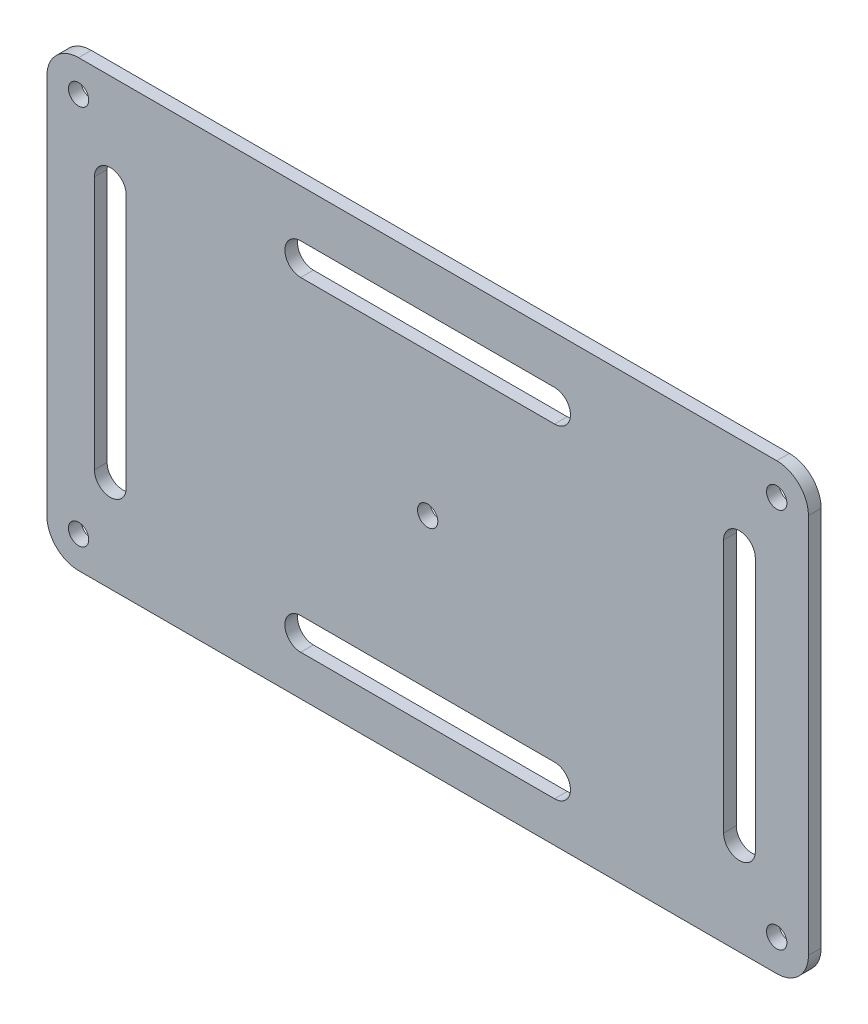
ISO-10303-21;
HEADER;
FILE_DESCRIPTION(('STEP AP214'),'2;1');
FILE_NAME('part.step','',(''),(''),'','','');
FILE_SCHEMA(('AUTOMOTIVE_DESIGN { 1 0 10303 214 1 1 1 1 }'));
ENDSEC;
DATA;
#1=APPLICATION_CONTEXT('core data for automotive mechanical design processes');
#2=APPLICATION_PROTOCOL_DEFINITION('international standard','automotive_design',2000,#1);
#3=PRODUCT_CONTEXT('',#1,'mechanical');
#4=PRODUCT('Part','Part','',(#3));
#5=PRODUCT_RELATED_PRODUCT_CATEGORY('part','',(#4));
#6=PRODUCT_DEFINITION_FORMATION('','',#4);
#7=PRODUCT_DEFINITION_CONTEXT('part definition',#1,'design');
#8=PRODUCT_DEFINITION('design','',#6,#7);
#9=PRODUCT_DEFINITION_SHAPE('','',#8);
#10=(LENGTH_UNIT() NAMED_UNIT(*) SI_UNIT(.MILLI.,.METRE.));
#11=(NAMED_UNIT(*) PLANE_ANGLE_UNIT() SI_UNIT($,.RADIAN.));
#12=(NAMED_UNIT(*) SI_UNIT($,.STERADIAN.) SOLID_ANGLE_UNIT());
#13=UNCERTAINTY_MEASURE_WITH_UNIT(LENGTH_MEASURE(1.E-05),#10,'distance_accuracy_value','');
#14=(GEOMETRIC_REPRESENTATION_CONTEXT(3) GLOBAL_UNCERTAINTY_ASSIGNED_CONTEXT((#13)) GLOBAL_UNIT_ASSIGNED_CONTEXT((#10,
#11,#12)) REPRESENTATION_CONTEXT('',''));
#15=CARTESIAN_POINT('',(0.,0.,0.));
#16=DIRECTION('',(0.,0.,1.));
#17=DIRECTION('',(1.,0.,0.));
#18=AXIS2_PLACEMENT_3D('',#15,#16,#17);
#19=CARTESIAN_POINT('',(60.,0.,2.));
#20=DIRECTION('',(1.,0.,0.));
#21=DIRECTION('',(0.,0.,-1.));
#22=AXIS2_PLACEMENT_3D('',#19,#20,#21);
#23=PLANE('',#22);
#24=DIRECTION('',(0.,-1.,0.));
#25=VECTOR('',#24,1.);
#26=CARTESIAN_POINT('',(60.,0.,0.));
#27=LINE('',#26,#25);
#28=CARTESIAN_POINT('',(60.,30.,0.));
#29=VERTEX_POINT('',#28);
#30=CARTESIAN_POINT('',(60.,-30.,0.));
#31=VERTEX_POINT('',#30);
#32=EDGE_CURVE('E299',#29,#31,#27,.T.);
#33=ORIENTED_EDGE('',*,*,#32,.F.);
#34=DIRECTION('',(0.,0.,-1.));
#35=VECTOR('',#34,1.);
#36=CARTESIAN_POINT('',(60.,30.,2.));
#37=LINE('',#36,#35);
#38=CARTESIAN_POINT('',(60.,30.,2.));
#39=VERTEX_POINT('',#38);
#40=EDGE_CURVE('E11',#39,#29,#37,.T.);
#41=ORIENTED_EDGE('',*,*,#40,.F.);
#42=DIRECTION('',(0.,-1.,0.));
#43=VECTOR('',#42,1.);
#44=CARTESIAN_POINT('',(60.,0.,2.));
#45=LINE('',#44,#43);
#46=CARTESIAN_POINT('',(60.,-30.,2.));
#47=VERTEX_POINT('',#46);
#48=EDGE_CURVE('E419',#39,#47,#45,.T.);
#49=ORIENTED_EDGE('',*,*,#48,.T.);
#50=DIRECTION('',(0.,0.,-1.));
#51=VECTOR('',#50,1.);
#52=CARTESIAN_POINT('',(60.,-30.,2.));
#53=LINE('',#52,#51);
#54=EDGE_CURVE('E140',#47,#31,#53,.T.);
#55=ORIENTED_EDGE('',*,*,#54,.T.);
#56=EDGE_LOOP('',(#33,#41,#49,#55));
#57=FACE_BOUND('',#56,.T.);
#58=ADVANCED_FACE('F39',(#57),#23,.T.);
#59=CARTESIAN_POINT('',(55.,30.,2.));
#60=DIRECTION('',(0.,0.,-1.));
#61=DIRECTION('',(-1.,0.,0.));
#62=AXIS2_PLACEMENT_3D('',#59,#60,#61);
#63=CYLINDRICAL_SURFACE('',#62,5.);
#64=CARTESIAN_POINT('',(55.,30.,0.));
#65=DIRECTION('',(0.,0.,1.));
#66=DIRECTION('',(1.,0.,0.));
#67=AXIS2_PLACEMENT_3D('',#64,#65,#66);
#68=CIRCLE('',#67,5.);
#69=CARTESIAN_POINT('',(55.,35.,0.));
#70=VERTEX_POINT('',#69);
#71=EDGE_CURVE('E302',#29,#70,#68,.T.);
#72=ORIENTED_EDGE('',*,*,#71,.T.);
#73=DIRECTION('',(0.,0.,-1.));
#74=VECTOR('',#73,1.);
#75=CARTESIAN_POINT('',(55.,35.,2.));
#76=LINE('',#75,#74);
#77=CARTESIAN_POINT('',(55.,35.,2.));
#78=VERTEX_POINT('',#77);
#79=EDGE_CURVE('E49',#78,#70,#76,.T.);
#80=ORIENTED_EDGE('',*,*,#79,.F.);
#81=CARTESIAN_POINT('',(55.,30.,2.));
#82=DIRECTION('',(0.,0.,1.));
#83=DIRECTION('',(1.,0.,0.));
#84=AXIS2_PLACEMENT_3D('',#81,#82,#83);
#85=CIRCLE('',#84,5.);
#86=EDGE_CURVE('E421',#39,#78,#85,.T.);
#87=ORIENTED_EDGE('',*,*,#86,.F.);
#88=ORIENTED_EDGE('',*,*,#40,.T.);
#89=EDGE_LOOP('',(#72,#80,#87,#88));
#90=FACE_BOUND('',#89,.T.);
#91=ADVANCED_FACE('F450',(#90),#63,.T.);
#92=CARTESIAN_POINT('',(0.,35.,2.));
#93=DIRECTION('',(0.,-1.,0.));
#94=DIRECTION('',(0.,0.,-1.));
#95=AXIS2_PLACEMENT_3D('',#92,#93,#94);
#96=PLANE('',#95);
#97=DIRECTION('',(-1.,0.,0.));
#98=VECTOR('',#97,1.);
#99=CARTESIAN_POINT('',(0.,35.,0.));
#100=LINE('',#99,#98);
#101=CARTESIAN_POINT('',(-55.,35.,0.));
#102=VERTEX_POINT('',#101);
#103=EDGE_CURVE('E305',#70,#102,#100,.T.);
#104=ORIENTED_EDGE('',*,*,#103,.T.);
#105=DIRECTION('',(0.,0.,-1.));
#106=VECTOR('',#105,1.);
#107=CARTESIAN_POINT('',(-55.,35.,2.));
#108=LINE('',#107,#106);
#109=CARTESIAN_POINT('',(-55.,35.,2.));
#110=VERTEX_POINT('',#109);
#111=EDGE_CURVE('E326',#110,#102,#108,.T.);
#112=ORIENTED_EDGE('',*,*,#111,.F.);
#113=DIRECTION('',(-1.,0.,0.));
#114=VECTOR('',#113,1.);
#115=CARTESIAN_POINT('',(0.,35.,2.));
#116=LINE('',#115,#114);
#117=EDGE_CURVE('E424',#78,#110,#116,.T.);
#118=ORIENTED_EDGE('',*,*,#117,.F.);
#119=ORIENTED_EDGE('',*,*,#79,.T.);
#120=EDGE_LOOP('',(#104,#112,#118,#119));
#121=FACE_BOUND('',#120,.T.);
#122=ADVANCED_FACE('F435',(#121),#96,.F.);
#123=CARTESIAN_POINT('',(-55.,30.,2.));
#124=DIRECTION('',(0.,0.,-1.));
#125=DIRECTION('',(-1.,0.,0.));
#126=AXIS2_PLACEMENT_3D('',#123,#124,#125);
#127=CYLINDRICAL_SURFACE('',#126,5.);
#128=CARTESIAN_POINT('',(-55.,30.,0.));
#129=DIRECTION('',(0.,0.,1.));
#130=DIRECTION('',(1.,0.,0.));
#131=AXIS2_PLACEMENT_3D('',#128,#129,#130);
#132=CIRCLE('',#131,5.);
#133=CARTESIAN_POINT('',(-60.,30.,0.));
#134=VERTEX_POINT('',#133);
#135=EDGE_CURVE('E308',#134,#102,#132,.F.);
#136=ORIENTED_EDGE('',*,*,#135,.F.);
#137=DIRECTION('',(0.,0.,-1.));
#138=VECTOR('',#137,1.);
#139=CARTESIAN_POINT('',(-60.,30.,2.));
#140=LINE('',#139,#138);
#141=CARTESIAN_POINT('',(-60.,30.,2.));
#142=VERTEX_POINT('',#141);
#143=EDGE_CURVE('E324',#142,#134,#140,.T.);
#144=ORIENTED_EDGE('',*,*,#143,.F.);
#145=CARTESIAN_POINT('',(-55.,30.,2.));
#146=DIRECTION('',(0.,0.,1.));
#147=DIRECTION('',(1.,0.,0.));
#148=AXIS2_PLACEMENT_3D('',#145,#146,#147);
#149=CIRCLE('',#148,5.);
#150=EDGE_CURVE('E426',#142,#110,#149,.F.);
#151=ORIENTED_EDGE('',*,*,#150,.T.);
#152=ORIENTED_EDGE('',*,*,#111,.T.);
#153=EDGE_LOOP('',(#136,#144,#151,#152));
#154=FACE_BOUND('',#153,.T.);
#155=ADVANCED_FACE('F430',(#154),#127,.T.);
#156=CARTESIAN_POINT('',(-60.,0.,2.));
#157=DIRECTION('',(1.,0.,0.));
#158=DIRECTION('',(0.,0.,-1.));
#159=AXIS2_PLACEMENT_3D('',#156,#157,#158);
#160=PLANE('',#159);
#161=DIRECTION('',(0.,-1.,0.));
#162=VECTOR('',#161,1.);
#163=CARTESIAN_POINT('',(-60.,0.,0.));
#164=LINE('',#163,#162);
#165=CARTESIAN_POINT('',(-60.,-30.,0.));
#166=VERTEX_POINT('',#165);
#167=EDGE_CURVE('E311',#134,#166,#164,.T.);
#168=ORIENTED_EDGE('',*,*,#167,.T.);
#169=DIRECTION('',(0.,0.,-1.));
#170=VECTOR('',#169,1.);
#171=CARTESIAN_POINT('',(-60.,-30.,2.));
#172=LINE('',#171,#170);
#173=CARTESIAN_POINT('',(-60.,-30.,2.));
#174=VERTEX_POINT('',#173);
#175=EDGE_CURVE('E228',#174,#166,#172,.T.);
#176=ORIENTED_EDGE('',*,*,#175,.F.);
#177=DIRECTION('',(0.,-1.,0.));
#178=VECTOR('',#177,1.);
#179=CARTESIAN_POINT('',(-60.,0.,2.));
#180=LINE('',#179,#178);
#181=EDGE_CURVE('E216',#142,#174,#180,.T.);
#182=ORIENTED_EDGE('',*,*,#181,.F.);
#183=ORIENTED_EDGE('',*,*,#143,.T.);
#184=EDGE_LOOP('',(#168,#176,#182,#183));
#185=FACE_BOUND('',#184,.T.);
#186=ADVANCED_FACE('F440',(#185),#160,.F.);
#187=CARTESIAN_POINT('',(-55.,-30.,2.));
#188=DIRECTION('',(0.,0.,-1.));
#189=DIRECTION('',(-1.,0.,0.));
#190=AXIS2_PLACEMENT_3D('',#187,#188,#189);
#191=CYLINDRICAL_SURFACE('',#190,5.);
#192=CARTESIAN_POINT('',(-55.,-30.,0.));
#193=DIRECTION('',(0.,0.,1.));
#194=DIRECTION('',(1.,0.,0.));
#195=AXIS2_PLACEMENT_3D('',#192,#193,#194);
#196=CIRCLE('',#195,5.);
#197=CARTESIAN_POINT('',(-55.,-35.,0.));
#198=VERTEX_POINT('',#197);
#199=EDGE_CURVE('E224',#166,#198,#196,.T.);
#200=ORIENTED_EDGE('',*,*,#199,.T.);
#201=DIRECTION('',(0.,0.,-1.));
#202=VECTOR('',#201,1.);
#203=CARTESIAN_POINT('',(-55.,-35.,2.));
#204=LINE('',#203,#202);
#205=CARTESIAN_POINT('',(-55.,-35.,2.));
#206=VERTEX_POINT('',#205);
#207=EDGE_CURVE('E222',#206,#198,#204,.T.);
#208=ORIENTED_EDGE('',*,*,#207,.F.);
#209=CARTESIAN_POINT('',(-55.,-30.,2.));
#210=DIRECTION('',(0.,0.,1.));
#211=DIRECTION('',(1.,0.,0.));
#212=AXIS2_PLACEMENT_3D('',#209,#210,#211);
#213=CIRCLE('',#212,5.);
#214=EDGE_CURVE('E209',#174,#206,#213,.T.);
#215=ORIENTED_EDGE('',*,*,#214,.F.);
#216=ORIENTED_EDGE('',*,*,#175,.T.);
#217=EDGE_LOOP('',(#200,#208,#215,#216));
#218=FACE_BOUND('',#217,.T.);
#219=ADVANCED_FACE('F223',(#218),#191,.T.);
#220=CARTESIAN_POINT('',(0.,-35.,2.));
#221=DIRECTION('',(0.,-1.,0.));
#222=DIRECTION('',(0.,0.,-1.));
#223=AXIS2_PLACEMENT_3D('',#220,#221,#222);
#224=PLANE('',#223);
#225=DIRECTION('',(-1.,0.,0.));
#226=VECTOR('',#225,1.);
#227=CARTESIAN_POINT('',(0.,-35.,0.));
#228=LINE('',#227,#226);
#229=CARTESIAN_POINT('',(55.,-35.,0.));
#230=VERTEX_POINT('',#229);
#231=EDGE_CURVE('E315',#230,#198,#228,.T.);
#232=ORIENTED_EDGE('',*,*,#231,.F.);
#233=DIRECTION('',(0.,0.,-1.));
#234=VECTOR('',#233,1.);
#235=CARTESIAN_POINT('',(55.,-35.,2.));
#236=LINE('',#235,#234);
#237=CARTESIAN_POINT('',(55.,-35.,2.));
#238=VERTEX_POINT('',#237);
#239=EDGE_CURVE('E133',#238,#230,#236,.T.);
#240=ORIENTED_EDGE('',*,*,#239,.F.);
#241=DIRECTION('',(-1.,0.,0.));
#242=VECTOR('',#241,1.);
#243=CARTESIAN_POINT('',(0.,-35.,2.));
#244=LINE('',#243,#242);
#245=EDGE_CURVE('E213',#238,#206,#244,.T.);
#246=ORIENTED_EDGE('',*,*,#245,.T.);
#247=ORIENTED_EDGE('',*,*,#207,.T.);
#248=EDGE_LOOP('',(#232,#240,#246,#247));
#249=FACE_BOUND('',#248,.T.);
#250=ADVANCED_FACE('F230',(#249),#224,.T.);
#251=CARTESIAN_POINT('',(49.1288715711617,-20.,2.));
#252=DIRECTION('',(0.,0.,-1.));
#253=DIRECTION('',(-1.,0.,0.));
#254=AXIS2_PLACEMENT_3D('',#251,#252,#253);
#255=CYLINDRICAL_SURFACE('',#254,2.50000000000001);
#256=CARTESIAN_POINT('',(49.1288715711617,-20.,0.));
#257=DIRECTION('',(0.,0.,1.));
#258=DIRECTION('',(1.,0.,0.));
#259=AXIS2_PLACEMENT_3D('',#256,#257,#258);
#260=CIRCLE('',#259,2.50000000000001);
#261=CARTESIAN_POINT('',(46.6288715711617,-20.,0.));
#262=VERTEX_POINT('',#261);
#263=CARTESIAN_POINT('',(51.6288715711617,-20.,0.));
#264=VERTEX_POINT('',#263);
#265=EDGE_CURVE('E287',#262,#264,#260,.T.);
#266=ORIENTED_EDGE('',*,*,#265,.F.);
#267=DIRECTION('',(0.,0.,-1.));
#268=VECTOR('',#267,1.);
#269=CARTESIAN_POINT('',(46.6288715711617,-20.,2.));
#270=LINE('',#269,#268);
#271=CARTESIAN_POINT('',(46.6288715711617,-20.,2.));
#272=VERTEX_POINT('',#271);
#273=EDGE_CURVE('E321',#272,#262,#270,.T.);
#274=ORIENTED_EDGE('',*,*,#273,.F.);
#275=CARTESIAN_POINT('',(49.1288715711617,-20.,2.));
#276=DIRECTION('',(0.,0.,1.));
#277=DIRECTION('',(1.,0.,0.));
#278=AXIS2_PLACEMENT_3D('',#275,#276,#277);
#279=CIRCLE('',#278,2.50000000000001);
#280=CARTESIAN_POINT('',(51.6288715711617,-20.,2.));
#281=VERTEX_POINT('',#280);
#282=EDGE_CURVE('E408',#272,#281,#279,.T.);
#283=ORIENTED_EDGE('',*,*,#282,.T.);
#284=DIRECTION('',(0.,0.,-1.));
#285=VECTOR('',#284,1.);
#286=CARTESIAN_POINT('',(51.6288715711617,-20.,2.));
#287=LINE('',#286,#285);
#288=EDGE_CURVE('E330',#281,#264,#287,.T.);
#289=ORIENTED_EDGE('',*,*,#288,.T.);
#290=EDGE_LOOP('',(#266,#274,#283,#289));
#291=FACE_BOUND('',#290,.T.);
#292=ADVANCED_FACE('F472',(#291),#255,.F.);
#293=CARTESIAN_POINT('',(46.6288715711617,0.,2.));
#294=DIRECTION('',(1.,0.,0.));
#295=DIRECTION('',(0.,1.,0.));
#296=AXIS2_PLACEMENT_3D('',#293,#294,#295);
#297=PLANE('',#296);
#298=DIRECTION('',(0.,-1.,0.));
#299=VECTOR('',#298,1.);
#300=CARTESIAN_POINT('',(46.6288715711617,0.,0.));
#301=LINE('',#300,#299);
#302=CARTESIAN_POINT('',(46.6288715711617,20.,0.));
#303=VERTEX_POINT('',#302);
#304=EDGE_CURVE('E290',#303,#262,#301,.T.);
#305=ORIENTED_EDGE('',*,*,#304,.F.);
#306=DIRECTION('',(0.,0.,-1.));
#307=VECTOR('',#306,1.);
#308=CARTESIAN_POINT('',(46.6288715711617,20.,2.));
#309=LINE('',#308,#307);
#310=CARTESIAN_POINT('',(46.6288715711617,20.,2.));
#311=VERTEX_POINT('',#310);
#312=EDGE_CURVE('E335',#311,#303,#309,.T.);
#313=ORIENTED_EDGE('',*,*,#312,.F.);
#314=DIRECTION('',(0.,-1.,0.));
#315=VECTOR('',#314,1.);
#316=CARTESIAN_POINT('',(46.6288715711617,0.,2.));
#317=LINE('',#316,#315);
#318=EDGE_CURVE('E411',#311,#272,#317,.T.);
#319=ORIENTED_EDGE('',*,*,#318,.T.);
#320=ORIENTED_EDGE('',*,*,#273,.T.);
#321=EDGE_LOOP('',(#305,#313,#319,#320));
#322=FACE_BOUND('',#321,.T.);
#323=ADVANCED_FACE('F468',(#322),#297,.T.);
#324=CARTESIAN_POINT('',(49.1288715711617,20.,2.));
#325=DIRECTION('',(0.,0.,-1.));
#326=DIRECTION('',(-1.,0.,0.));
#327=AXIS2_PLACEMENT_3D('',#324,#325,#326);
#328=CYLINDRICAL_SURFACE('',#327,2.50000000000001);
#329=CARTESIAN_POINT('',(49.1288715711617,20.,0.));
#330=DIRECTION('',(0.,0.,1.));
#331=DIRECTION('',(1.,0.,0.));
#332=AXIS2_PLACEMENT_3D('',#329,#330,#331);
#333=CIRCLE('',#332,2.50000000000001);
#334=CARTESIAN_POINT('',(51.6288715711617,20.,0.));
#335=VERTEX_POINT('',#334);
#336=EDGE_CURVE('E293',#335,#303,#333,.T.);
#337=ORIENTED_EDGE('',*,*,#336,.F.);
#338=DIRECTION('',(0.,0.,-1.));
#339=VECTOR('',#338,1.);
#340=CARTESIAN_POINT('',(51.6288715711617,20.,2.));
#341=LINE('',#340,#339);
#342=CARTESIAN_POINT('',(51.6288715711617,20.,2.));
#343=VERTEX_POINT('',#342);
#344=EDGE_CURVE('E332',#343,#335,#341,.T.);
#345=ORIENTED_EDGE('',*,*,#344,.F.);
#346=CARTESIAN_POINT('',(49.1288715711617,20.,2.));
#347=DIRECTION('',(0.,0.,1.));
#348=DIRECTION('',(1.,0.,0.));
#349=AXIS2_PLACEMENT_3D('',#346,#347,#348);
#350=CIRCLE('',#349,2.50000000000001);
#351=EDGE_CURVE('E414',#343,#311,#350,.T.);
#352=ORIENTED_EDGE('',*,*,#351,.T.);
#353=ORIENTED_EDGE('',*,*,#312,.T.);
#354=EDGE_LOOP('',(#337,#345,#352,#353));
#355=FACE_BOUND('',#354,.T.);
#356=ADVANCED_FACE('F464',(#355),#328,.F.);
#357=CARTESIAN_POINT('',(20.,-26.136211524614,2.));
#358=DIRECTION('',(0.,0.,-1.));
#359=DIRECTION('',(-1.,0.,0.));
#360=AXIS2_PLACEMENT_3D('',#357,#358,#359);
#361=CYLINDRICAL_SURFACE('',#360,2.5);
#362=CARTESIAN_POINT('',(20.,-26.136211524614,0.));
#363=DIRECTION('',(0.,0.,1.));
#364=DIRECTION('',(1.,0.,0.));
#365=AXIS2_PLACEMENT_3D('',#362,#363,#364);
#366=CIRCLE('',#365,2.5);
#367=CARTESIAN_POINT('',(20.,-28.636211524614,0.));
#368=VERTEX_POINT('',#367);
#369=CARTESIAN_POINT('',(20.,-23.636211524614,0.));
#370=VERTEX_POINT('',#369);
#371=EDGE_CURVE('E275',#368,#370,#366,.T.);
#372=ORIENTED_EDGE('',*,*,#371,.F.);
#373=DIRECTION('',(0.,0.,-1.));
#374=VECTOR('',#373,1.);
#375=CARTESIAN_POINT('',(20.,-28.636211524614,2.));
#376=LINE('',#375,#374);
#377=CARTESIAN_POINT('',(20.,-28.636211524614,2.));
#378=VERTEX_POINT('',#377);
#379=EDGE_CURVE('E333',#378,#368,#376,.T.);
#380=ORIENTED_EDGE('',*,*,#379,.F.);
#381=CARTESIAN_POINT('',(20.,-26.136211524614,2.));
#382=DIRECTION('',(0.,0.,1.));
#383=DIRECTION('',(1.,0.,0.));
#384=AXIS2_PLACEMENT_3D('',#381,#382,#383);
#385=CIRCLE('',#384,2.5);
#386=CARTESIAN_POINT('',(20.,-23.636211524614,2.));
#387=VERTEX_POINT('',#386);
#388=EDGE_CURVE('E397',#378,#387,#385,.T.);
#389=ORIENTED_EDGE('',*,*,#388,.T.);
#390=DIRECTION('',(0.,0.,-1.));
#391=VECTOR('',#390,1.);
#392=CARTESIAN_POINT('',(20.,-23.636211524614,2.));
#393=LINE('',#392,#391);
#394=EDGE_CURVE('E338',#387,#370,#393,.T.);
#395=ORIENTED_EDGE('',*,*,#394,.T.);
#396=EDGE_LOOP('',(#372,#380,#389,#395));
#397=FACE_BOUND('',#396,.T.);
#398=ADVANCED_FACE('F467',(#397),#361,.F.);
#399=CARTESIAN_POINT('',(0.,-28.636211524614,2.));
#400=DIRECTION('',(0.,1.,0.));
#401=DIRECTION('',(0.,0.,1.));
#402=AXIS2_PLACEMENT_3D('',#399,#400,#401);
#403=PLANE('',#402);
#404=DIRECTION('',(1.,0.,0.));
#405=VECTOR('',#404,1.);
#406=CARTESIAN_POINT('',(0.,-28.636211524614,0.));
#407=LINE('',#406,#405);
#408=CARTESIAN_POINT('',(-20.,-28.636211524614,0.));
#409=VERTEX_POINT('',#408);
#410=EDGE_CURVE('E278',#409,#368,#407,.T.);
#411=ORIENTED_EDGE('',*,*,#410,.F.);
#412=DIRECTION('',(0.,0.,-1.));
#413=VECTOR('',#412,1.);
#414=CARTESIAN_POINT('',(-20.,-28.636211524614,2.));
#415=LINE('',#414,#413);
#416=CARTESIAN_POINT('',(-20.,-28.636211524614,2.));
#417=VERTEX_POINT('',#416);
#418=EDGE_CURVE('E343',#417,#409,#415,.T.);
#419=ORIENTED_EDGE('',*,*,#418,.F.);
#420=DIRECTION('',(1.,0.,0.));
#421=VECTOR('',#420,1.);
#422=CARTESIAN_POINT('',(0.,-28.636211524614,2.));
#423=LINE('',#422,#421);
#424=EDGE_CURVE('E400',#417,#378,#423,.T.);
#425=ORIENTED_EDGE('',*,*,#424,.T.);
#426=ORIENTED_EDGE('',*,*,#379,.T.);
#427=EDGE_LOOP('',(#411,#419,#425,#426));
#428=FACE_BOUND('',#427,.T.);
#429=ADVANCED_FACE('F485',(#428),#403,.T.);
#430=CARTESIAN_POINT('',(-20.,-26.136211524614,2.));
#431=DIRECTION('',(0.,0.,-1.));
#432=DIRECTION('',(-1.,0.,0.));
#433=AXIS2_PLACEMENT_3D('',#430,#431,#432);
#434=CYLINDRICAL_SURFACE('',#433,2.5);
#435=CARTESIAN_POINT('',(-20.,-26.136211524614,0.));
#436=DIRECTION('',(0.,0.,1.));
#437=DIRECTION('',(1.,0.,0.));
#438=AXIS2_PLACEMENT_3D('',#435,#436,#437);
#439=CIRCLE('',#438,2.5);
#440=CARTESIAN_POINT('',(-20.,-23.636211524614,0.));
#441=VERTEX_POINT('',#440);
#442=EDGE_CURVE('E281',#441,#409,#439,.T.);
#443=ORIENTED_EDGE('',*,*,#442,.F.);
#444=DIRECTION('',(0.,0.,-1.));
#445=VECTOR('',#444,1.);
#446=CARTESIAN_POINT('',(-20.,-23.636211524614,2.));
#447=LINE('',#446,#445);
#448=CARTESIAN_POINT('',(-20.,-23.636211524614,2.));
#449=VERTEX_POINT('',#448);
#450=EDGE_CURVE('E340',#449,#441,#447,.T.);
#451=ORIENTED_EDGE('',*,*,#450,.F.);
#452=CARTESIAN_POINT('',(-20.,-26.136211524614,2.));
#453=DIRECTION('',(0.,0.,1.));
#454=DIRECTION('',(1.,0.,0.));
#455=AXIS2_PLACEMENT_3D('',#452,#453,#454);
#456=CIRCLE('',#455,2.5);
#457=EDGE_CURVE('E403',#449,#417,#456,.T.);
#458=ORIENTED_EDGE('',*,*,#457,.T.);
#459=ORIENTED_EDGE('',*,*,#418,.T.);
#460=EDGE_LOOP('',(#443,#451,#458,#459));
#461=FACE_BOUND('',#460,.T.);
#462=ADVANCED_FACE('F481',(#461),#434,.F.);
#463=CARTESIAN_POINT('',(-50.,-20.,2.));
#464=DIRECTION('',(0.,0.,-1.));
#465=DIRECTION('',(-1.,0.,0.));
#466=AXIS2_PLACEMENT_3D('',#463,#464,#465);
#467=CYLINDRICAL_SURFACE('',#466,2.49999999999999);
#468=CARTESIAN_POINT('',(-50.,-20.,0.));
#469=DIRECTION('',(0.,0.,1.));
#470=DIRECTION('',(1.,0.,0.));
#471=AXIS2_PLACEMENT_3D('',#468,#469,#470);
#472=CIRCLE('',#471,2.49999999999999);
#473=CARTESIAN_POINT('',(-52.5,-20.,0.));
#474=VERTEX_POINT('',#473);
#475=CARTESIAN_POINT('',(-47.5,-20.,0.));
#476=VERTEX_POINT('',#475);
#477=EDGE_CURVE('E263',#474,#476,#472,.T.);
#478=ORIENTED_EDGE('',*,*,#477,.F.);
#479=DIRECTION('',(0.,0.,-1.));
#480=VECTOR('',#479,1.);
#481=CARTESIAN_POINT('',(-52.5,-20.,2.));
#482=LINE('',#481,#480);
#483=CARTESIAN_POINT('',(-52.5,-20.,2.));
#484=VERTEX_POINT('',#483);
#485=EDGE_CURVE('E341',#484,#474,#482,.T.);
#486=ORIENTED_EDGE('',*,*,#485,.F.);
#487=CARTESIAN_POINT('',(-50.,-20.,2.));
#488=DIRECTION('',(0.,0.,1.));
#489=DIRECTION('',(1.,0.,0.));
#490=AXIS2_PLACEMENT_3D('',#487,#488,#489);
#491=CIRCLE('',#490,2.49999999999999);
#492=CARTESIAN_POINT('',(-47.5,-20.,2.));
#493=VERTEX_POINT('',#492);
#494=EDGE_CURVE('E379',#484,#493,#491,.T.);
#495=ORIENTED_EDGE('',*,*,#494,.T.);
#496=DIRECTION('',(0.,0.,-1.));
#497=VECTOR('',#496,1.);
#498=CARTESIAN_POINT('',(-47.5,-20.,2.));
#499=LINE('',#498,#497);
#500=EDGE_CURVE('E346',#493,#476,#499,.T.);
#501=ORIENTED_EDGE('',*,*,#500,.T.);
#502=EDGE_LOOP('',(#478,#486,#495,#501));
#503=FACE_BOUND('',#502,.T.);
#504=ADVANCED_FACE('F484',(#503),#467,.F.);
#505=CARTESIAN_POINT('',(-52.5,0.,2.));
#506=DIRECTION('',(1.,0.,0.));
#507=DIRECTION('',(0.,1.,0.));
#508=AXIS2_PLACEMENT_3D('',#505,#506,#507);
#509=PLANE('',#508);
#510=DIRECTION('',(0.,-1.,0.));
#511=VECTOR('',#510,1.);
#512=CARTESIAN_POINT('',(-52.5,0.,0.));
#513=LINE('',#512,#511);
#514=CARTESIAN_POINT('',(-52.5,20.,0.));
#515=VERTEX_POINT('',#514);
#516=EDGE_CURVE('E266',#515,#474,#513,.T.);
#517=ORIENTED_EDGE('',*,*,#516,.F.);
#518=DIRECTION('',(0.,0.,-1.));
#519=VECTOR('',#518,1.);
#520=CARTESIAN_POINT('',(-52.5,20.,2.));
#521=LINE('',#520,#519);
#522=CARTESIAN_POINT('',(-52.5,20.,2.));
#523=VERTEX_POINT('',#522);
#524=EDGE_CURVE('E350',#523,#515,#521,.T.);
#525=ORIENTED_EDGE('',*,*,#524,.F.);
#526=DIRECTION('',(0.,-1.,0.));
#527=VECTOR('',#526,1.);
#528=CARTESIAN_POINT('',(-52.5,0.,2.));
#529=LINE('',#528,#527);
#530=EDGE_CURVE('E389',#523,#484,#529,.T.);
#531=ORIENTED_EDGE('',*,*,#530,.T.);
#532=ORIENTED_EDGE('',*,*,#485,.T.);
#533=EDGE_LOOP('',(#517,#525,#531,#532));
#534=FACE_BOUND('',#533,.T.);
#535=ADVANCED_FACE('F499',(#534),#509,.T.);
#536=CARTESIAN_POINT('',(-50.,20.,2.));
#537=DIRECTION('',(0.,0.,-1.));
#538=DIRECTION('',(-1.,0.,0.));
#539=AXIS2_PLACEMENT_3D('',#536,#537,#538);
#540=CYLINDRICAL_SURFACE('',#539,2.49999999999999);
#541=CARTESIAN_POINT('',(-50.,20.,0.));
#542=DIRECTION('',(0.,0.,1.));
#543=DIRECTION('',(1.,0.,0.));
#544=AXIS2_PLACEMENT_3D('',#541,#542,#543);
#545=CIRCLE('',#544,2.49999999999999);
#546=CARTESIAN_POINT('',(-47.5,20.,0.));
#547=VERTEX_POINT('',#546);
#548=EDGE_CURVE('E269',#547,#515,#545,.T.);
#549=ORIENTED_EDGE('',*,*,#548,.F.);
#550=DIRECTION('',(0.,0.,-1.));
#551=VECTOR('',#550,1.);
#552=CARTESIAN_POINT('',(-47.5,20.,2.));
#553=LINE('',#552,#551);
#554=CARTESIAN_POINT('',(-47.5,20.,2.));
#555=VERTEX_POINT('',#554);
#556=EDGE_CURVE('E348',#555,#547,#553,.T.);
#557=ORIENTED_EDGE('',*,*,#556,.F.);
#558=CARTESIAN_POINT('',(-50.,20.,2.));
#559=DIRECTION('',(0.,0.,1.));
#560=DIRECTION('',(1.,0.,0.));
#561=AXIS2_PLACEMENT_3D('',#558,#559,#560);
#562=CIRCLE('',#561,2.49999999999999);
#563=EDGE_CURVE('E392',#555,#523,#562,.T.);
#564=ORIENTED_EDGE('',*,*,#563,.T.);
#565=ORIENTED_EDGE('',*,*,#524,.T.);
#566=EDGE_LOOP('',(#549,#557,#564,#565));
#567=FACE_BOUND('',#566,.T.);
#568=ADVANCED_FACE('F496',(#567),#540,.F.);
#569=CARTESIAN_POINT('',(20.,25.,2.));
#570=DIRECTION('',(0.,0.,-1.));
#571=DIRECTION('',(-1.,0.,0.));
#572=AXIS2_PLACEMENT_3D('',#569,#570,#571);
#573=CYLINDRICAL_SURFACE('',#572,2.5);
#574=CARTESIAN_POINT('',(20.,25.,0.));
#575=DIRECTION('',(0.,0.,1.));
#576=DIRECTION('',(1.,0.,0.));
#577=AXIS2_PLACEMENT_3D('',#574,#575,#576);
#578=CIRCLE('',#577,2.5);
#579=CARTESIAN_POINT('',(20.,22.5,0.));
#580=VERTEX_POINT('',#579);
#581=CARTESIAN_POINT('',(20.,27.5,0.));
#582=VERTEX_POINT('',#581);
#583=EDGE_CURVE('E251',#580,#582,#578,.T.);
#584=ORIENTED_EDGE('',*,*,#583,.F.);
#585=DIRECTION('',(0.,0.,-1.));
#586=VECTOR('',#585,1.);
#587=CARTESIAN_POINT('',(20.,22.5,2.));
#588=LINE('',#587,#586);
#589=CARTESIAN_POINT('',(20.,22.5,2.));
#590=VERTEX_POINT('',#589);
#591=EDGE_CURVE('E43',#590,#580,#588,.T.);
#592=ORIENTED_EDGE('',*,*,#591,.F.);
#593=CARTESIAN_POINT('',(20.,25.,2.));
#594=DIRECTION('',(0.,0.,1.));
#595=DIRECTION('',(1.,0.,0.));
#596=AXIS2_PLACEMENT_3D('',#593,#594,#595);
#597=CIRCLE('',#596,2.5);
#598=CARTESIAN_POINT('',(20.,27.5,2.));
#599=VERTEX_POINT('',#598);
#600=EDGE_CURVE('E383',#590,#599,#597,.T.);
#601=ORIENTED_EDGE('',*,*,#600,.T.);
#602=DIRECTION('',(0.,0.,-1.));
#603=VECTOR('',#602,1.);
#604=CARTESIAN_POINT('',(20.,27.5,2.));
#605=LINE('',#604,#603);
#606=EDGE_CURVE('E232',#599,#582,#605,.T.);
#607=ORIENTED_EDGE('',*,*,#606,.T.);
#608=EDGE_LOOP('',(#584,#592,#601,#607));
#609=FACE_BOUND('',#608,.T.);
#610=ADVANCED_FACE('F365',(#609),#573,.F.);
#611=CARTESIAN_POINT('',(0.,22.5,2.));
#612=DIRECTION('',(0.,1.,0.));
#613=DIRECTION('',(0.,0.,1.));
#614=AXIS2_PLACEMENT_3D('',#611,#612,#613);
#615=PLANE('',#614);
#616=DIRECTION('',(1.,0.,0.));
#617=VECTOR('',#616,1.);
#618=CARTESIAN_POINT('',(0.,22.5,0.));
#619=LINE('',#618,#617);
#620=CARTESIAN_POINT('',(-20.,22.5,0.));
#621=VERTEX_POINT('',#620);
#622=EDGE_CURVE('E254',#621,#580,#619,.T.);
#623=ORIENTED_EDGE('',*,*,#622,.F.);
#624=DIRECTION('',(0.,0.,-1.));
#625=VECTOR('',#624,1.);
#626=CARTESIAN_POINT('',(-20.,22.5,2.));
#627=LINE('',#626,#625);
#628=CARTESIAN_POINT('',(-20.,22.5,2.));
#629=VERTEX_POINT('',#628);
#630=EDGE_CURVE('E355',#629,#621,#627,.T.);
#631=ORIENTED_EDGE('',*,*,#630,.F.);
#632=DIRECTION('',(1.,0.,0.));
#633=VECTOR('',#632,1.);
#634=CARTESIAN_POINT('',(0.,22.5,2.));
#635=LINE('',#634,#633);
#636=EDGE_CURVE('E364',#629,#590,#635,.T.);
#637=ORIENTED_EDGE('',*,*,#636,.T.);
#638=ORIENTED_EDGE('',*,*,#591,.T.);
#639=EDGE_LOOP('',(#623,#631,#637,#638));
#640=FACE_BOUND('',#639,.T.);
#641=ADVANCED_FACE('F362',(#640),#615,.T.);
#642=CARTESIAN_POINT('',(-20.,25.,2.));
#643=DIRECTION('',(0.,0.,-1.));
#644=DIRECTION('',(-1.,0.,0.));
#645=AXIS2_PLACEMENT_3D('',#642,#643,#644);
#646=CYLINDRICAL_SURFACE('',#645,2.5);
#647=CARTESIAN_POINT('',(-20.,25.,0.));
#648=DIRECTION('',(0.,0.,1.));
#649=DIRECTION('',(1.,0.,0.));
#650=AXIS2_PLACEMENT_3D('',#647,#648,#649);
#651=CIRCLE('',#650,2.5);
#652=CARTESIAN_POINT('',(-20.,27.5,0.));
#653=VERTEX_POINT('',#652);
#654=EDGE_CURVE('E257',#653,#621,#651,.T.);
#655=ORIENTED_EDGE('',*,*,#654,.F.);
#656=DIRECTION('',(0.,0.,-1.));
#657=VECTOR('',#656,1.);
#658=CARTESIAN_POINT('',(-20.,27.5,2.));
#659=LINE('',#658,#657);
#660=CARTESIAN_POINT('',(-20.,27.5,2.));
#661=VERTEX_POINT('',#660);
#662=EDGE_CURVE('E354',#661,#653,#659,.T.);
#663=ORIENTED_EDGE('',*,*,#662,.F.);
#664=CARTESIAN_POINT('',(-20.,25.,2.));
#665=DIRECTION('',(0.,0.,1.));
#666=DIRECTION('',(1.,0.,0.));
#667=AXIS2_PLACEMENT_3D('',#664,#665,#666);
#668=CIRCLE('',#667,2.5);
#669=EDGE_CURVE('E374',#661,#629,#668,.T.);
#670=ORIENTED_EDGE('',*,*,#669,.T.);
#671=ORIENTED_EDGE('',*,*,#630,.T.);
#672=EDGE_LOOP('',(#655,#663,#670,#671));
#673=FACE_BOUND('',#672,.T.);
#674=ADVANCED_FACE('F371',(#673),#646,.F.);
#675=CARTESIAN_POINT('',(51.6288715711617,0.,2.));
#676=DIRECTION('',(1.,0.,0.));
#677=DIRECTION('',(0.,1.,0.));
#678=AXIS2_PLACEMENT_3D('',#675,#676,#677);
#679=PLANE('',#678);
#680=DIRECTION('',(0.,-1.,0.));
#681=VECTOR('',#680,1.);
#682=CARTESIAN_POINT('',(51.6288715711617,0.,0.));
#683=LINE('',#682,#681);
#684=EDGE_CURVE('E296',#335,#264,#683,.T.);
#685=ORIENTED_EDGE('',*,*,#684,.T.);
#686=ORIENTED_EDGE('',*,*,#288,.F.);
#687=DIRECTION('',(0.,-1.,0.));
#688=VECTOR('',#687,1.);
#689=CARTESIAN_POINT('',(51.6288715711617,0.,2.));
#690=LINE('',#689,#688);
#691=EDGE_CURVE('E417',#343,#281,#690,.T.);
#692=ORIENTED_EDGE('',*,*,#691,.F.);
#693=ORIENTED_EDGE('',*,*,#344,.T.);
#694=EDGE_LOOP('',(#685,#686,#692,#693));
#695=FACE_BOUND('',#694,.T.);
#696=ADVANCED_FACE('F459',(#695),#679,.F.);
#697=CARTESIAN_POINT('',(0.,-23.636211524614,2.));
#698=DIRECTION('',(0.,1.,0.));
#699=DIRECTION('',(0.,0.,1.));
#700=AXIS2_PLACEMENT_3D('',#697,#698,#699);
#701=PLANE('',#700);
#702=DIRECTION('',(1.,0.,0.));
#703=VECTOR('',#702,1.);
#704=CARTESIAN_POINT('',(0.,-23.636211524614,0.));
#705=LINE('',#704,#703);
#706=EDGE_CURVE('E284',#441,#370,#705,.T.);
#707=ORIENTED_EDGE('',*,*,#706,.T.);
#708=ORIENTED_EDGE('',*,*,#394,.F.);
#709=DIRECTION('',(1.,0.,0.));
#710=VECTOR('',#709,1.);
#711=CARTESIAN_POINT('',(0.,-23.636211524614,2.));
#712=LINE('',#711,#710);
#713=EDGE_CURVE('E406',#449,#387,#712,.T.);
#714=ORIENTED_EDGE('',*,*,#713,.F.);
#715=ORIENTED_EDGE('',*,*,#450,.T.);
#716=EDGE_LOOP('',(#707,#708,#714,#715));
#717=FACE_BOUND('',#716,.T.);
#718=ADVANCED_FACE('F462',(#717),#701,.F.);
#719=CARTESIAN_POINT('',(-47.5,0.,2.));
#720=DIRECTION('',(1.,0.,0.));
#721=DIRECTION('',(0.,1.,0.));
#722=AXIS2_PLACEMENT_3D('',#719,#720,#721);
#723=PLANE('',#722);
#724=DIRECTION('',(0.,-1.,0.));
#725=VECTOR('',#724,1.);
#726=CARTESIAN_POINT('',(-47.5,0.,0.));
#727=LINE('',#726,#725);
#728=EDGE_CURVE('E272',#547,#476,#727,.T.);
#729=ORIENTED_EDGE('',*,*,#728,.T.);
#730=ORIENTED_EDGE('',*,*,#500,.F.);
#731=DIRECTION('',(0.,-1.,0.));
#732=VECTOR('',#731,1.);
#733=CARTESIAN_POINT('',(-47.5,0.,2.));
#734=LINE('',#733,#732);
#735=EDGE_CURVE('E395',#555,#493,#734,.T.);
#736=ORIENTED_EDGE('',*,*,#735,.F.);
#737=ORIENTED_EDGE('',*,*,#556,.T.);
#738=EDGE_LOOP('',(#729,#730,#736,#737));
#739=FACE_BOUND('',#738,.T.);
#740=ADVANCED_FACE('F479',(#739),#723,.F.);
#741=CARTESIAN_POINT('',(0.,27.5,2.));
#742=DIRECTION('',(0.,1.,0.));
#743=DIRECTION('',(0.,0.,1.));
#744=AXIS2_PLACEMENT_3D('',#741,#742,#743);
#745=PLANE('',#744);
#746=DIRECTION('',(1.,0.,0.));
#747=VECTOR('',#746,1.);
#748=CARTESIAN_POINT('',(0.,27.5,0.));
#749=LINE('',#748,#747);
#750=EDGE_CURVE('E260',#653,#582,#749,.T.);
#751=ORIENTED_EDGE('',*,*,#750,.T.);
#752=ORIENTED_EDGE('',*,*,#606,.F.);
#753=DIRECTION('',(1.,0.,0.));
#754=VECTOR('',#753,1.);
#755=CARTESIAN_POINT('',(0.,27.5,2.));
#756=LINE('',#755,#754);
#757=EDGE_CURVE('E376',#661,#599,#756,.T.);
#758=ORIENTED_EDGE('',*,*,#757,.F.);
#759=ORIENTED_EDGE('',*,*,#662,.T.);
#760=EDGE_LOOP('',(#751,#752,#758,#759));
#761=FACE_BOUND('',#760,.T.);
#762=ADVANCED_FACE('F377',(#761),#745,.F.);
#763=CARTESIAN_POINT('',(0.,0.,2.));
#764=DIRECTION('',(0.,0.,-1.));
#765=DIRECTION('',(-1.,0.,0.));
#766=AXIS2_PLACEMENT_3D('',#763,#764,#765);
#767=CYLINDRICAL_SURFACE('',#766,1.6);
#768=CARTESIAN_POINT('',(0.,0.,2.));
#769=DIRECTION('',(0.,0.,1.));
#770=DIRECTION('',(1.,0.,0.));
#771=AXIS2_PLACEMENT_3D('',#768,#769,#770);
#772=CIRCLE('',#771,1.6);
#773=CARTESIAN_POINT('',(1.6,0.,2.));
#774=VERTEX_POINT('',#773);
#775=EDGE_CURVE('E818',#774,#774,#772,.T.);
#776=ORIENTED_EDGE('',*,*,#775,.T.);
#777=EDGE_LOOP('',(#776));
#778=FACE_BOUND('',#777,.T.);
#779=CARTESIAN_POINT('',(0.,0.,0.));
#780=DIRECTION('',(0.,0.,1.));
#781=DIRECTION('',(1.,0.,0.));
#782=AXIS2_PLACEMENT_3D('',#779,#780,#781);
#783=CIRCLE('',#782,1.6);
#784=CARTESIAN_POINT('',(1.6,0.,0.));
#785=VERTEX_POINT('',#784);
#786=EDGE_CURVE('E248',#785,#785,#783,.T.);
#787=ORIENTED_EDGE('',*,*,#786,.F.);
#788=EDGE_LOOP('',(#787));
#789=FACE_BOUND('',#788,.T.);
#790=ADVANCED_FACE('F509',(#778,#789),#767,.F.);
#791=CARTESIAN_POINT('',(55.,30.,2.));
#792=DIRECTION('',(0.,0.,-1.));
#793=DIRECTION('',(-1.,0.,0.));
#794=AXIS2_PLACEMENT_3D('',#791,#792,#793);
#795=CYLINDRICAL_SURFACE('',#794,1.6);
#796=CARTESIAN_POINT('',(55.,30.,2.));
#797=DIRECTION('',(0.,0.,1.));
#798=DIRECTION('',(1.,0.,0.));
#799=AXIS2_PLACEMENT_3D('',#796,#797,#798);
#800=CIRCLE('',#799,1.6);
#801=CARTESIAN_POINT('',(56.6,30.,2.));
#802=VERTEX_POINT('',#801);
#803=EDGE_CURVE('E815',#802,#802,#800,.T.);
#804=ORIENTED_EDGE('',*,*,#803,.T.);
#805=EDGE_LOOP('',(#804));
#806=FACE_BOUND('',#805,.T.);
#807=CARTESIAN_POINT('',(55.,30.,0.));
#808=DIRECTION('',(0.,0.,1.));
#809=DIRECTION('',(1.,0.,0.));
#810=AXIS2_PLACEMENT_3D('',#807,#808,#809);
#811=CIRCLE('',#810,1.6);
#812=CARTESIAN_POINT('',(56.6,30.,0.));
#813=VERTEX_POINT('',#812);
#814=EDGE_CURVE('E245',#813,#813,#811,.T.);
#815=ORIENTED_EDGE('',*,*,#814,.F.);
#816=EDGE_LOOP('',(#815));
#817=FACE_BOUND('',#816,.T.);
#818=ADVANCED_FACE('F518',(#806,#817),#795,.F.);
#819=CARTESIAN_POINT('',(55.,-30.,2.));
#820=DIRECTION('',(0.,0.,-1.));
#821=DIRECTION('',(-1.,0.,0.));
#822=AXIS2_PLACEMENT_3D('',#819,#820,#821);
#823=CYLINDRICAL_SURFACE('',#822,1.6);
#824=CARTESIAN_POINT('',(55.,-30.,2.));
#825=DIRECTION('',(0.,0.,1.));
#826=DIRECTION('',(1.,0.,0.));
#827=AXIS2_PLACEMENT_3D('',#824,#825,#826);
#828=CIRCLE('',#827,1.6);
#829=CARTESIAN_POINT('',(56.6,-30.,2.));
#830=VERTEX_POINT('',#829);
#831=EDGE_CURVE('E811',#830,#830,#828,.T.);
#832=ORIENTED_EDGE('',*,*,#831,.T.);
#833=EDGE_LOOP('',(#832));
#834=FACE_BOUND('',#833,.T.);
#835=CARTESIAN_POINT('',(55.,-30.,0.));
#836=DIRECTION('',(0.,0.,1.));
#837=DIRECTION('',(1.,0.,0.));
#838=AXIS2_PLACEMENT_3D('',#835,#836,#837);
#839=CIRCLE('',#838,1.6);
#840=CARTESIAN_POINT('',(56.6,-30.,0.));
#841=VERTEX_POINT('',#840);
#842=EDGE_CURVE('E242',#841,#841,#839,.T.);
#843=ORIENTED_EDGE('',*,*,#842,.F.);
#844=EDGE_LOOP('',(#843));
#845=FACE_BOUND('',#844,.T.);
#846=ADVANCED_FACE('F522',(#834,#845),#823,.F.);
#847=CARTESIAN_POINT('',(-55.,-30.,2.));
#848=DIRECTION('',(0.,0.,-1.));
#849=DIRECTION('',(-1.,0.,0.));
#850=AXIS2_PLACEMENT_3D('',#847,#848,#849);
#851=CYLINDRICAL_SURFACE('',#850,1.6);
#852=CARTESIAN_POINT('',(-55.,-30.,2.));
#853=DIRECTION('',(0.,0.,1.));
#854=DIRECTION('',(1.,0.,0.));
#855=AXIS2_PLACEMENT_3D('',#852,#853,#854);
#856=CIRCLE('',#855,1.6);
#857=CARTESIAN_POINT('',(-53.4,-30.,2.));
#858=VERTEX_POINT('',#857);
#859=EDGE_CURVE('E537',#858,#858,#856,.T.);
#860=ORIENTED_EDGE('',*,*,#859,.T.);
#861=EDGE_LOOP('',(#860));
#862=FACE_BOUND('',#861,.T.);
#863=CARTESIAN_POINT('',(-55.,-30.,0.));
#864=DIRECTION('',(0.,0.,1.));
#865=DIRECTION('',(1.,0.,0.));
#866=AXIS2_PLACEMENT_3D('',#863,#864,#865);
#867=CIRCLE('',#866,1.6);
#868=CARTESIAN_POINT('',(-53.4,-30.,0.));
#869=VERTEX_POINT('',#868);
#870=EDGE_CURVE('E239',#869,#869,#867,.T.);
#871=ORIENTED_EDGE('',*,*,#870,.F.);
#872=EDGE_LOOP('',(#871));
#873=FACE_BOUND('',#872,.T.);
#874=ADVANCED_FACE('F525',(#862,#873),#851,.F.);
#875=CARTESIAN_POINT('',(-55.,30.,2.));
#876=DIRECTION('',(0.,0.,-1.));
#877=DIRECTION('',(-1.,0.,0.));
#878=AXIS2_PLACEMENT_3D('',#875,#876,#877);
#879=CYLINDRICAL_SURFACE('',#878,1.6);
#880=CARTESIAN_POINT('',(-55.,30.,2.));
#881=DIRECTION('',(0.,0.,1.));
#882=DIRECTION('',(1.,0.,0.));
#883=AXIS2_PLACEMENT_3D('',#880,#881,#882);
#884=CIRCLE('',#883,1.6);
#885=CARTESIAN_POINT('',(-53.4,30.,2.));
#886=VERTEX_POINT('',#885);
#887=EDGE_CURVE('E319',#886,#886,#884,.T.);
#888=ORIENTED_EDGE('',*,*,#887,.T.);
#889=EDGE_LOOP('',(#888));
#890=FACE_BOUND('',#889,.T.);
#891=CARTESIAN_POINT('',(-55.,30.,0.));
#892=DIRECTION('',(0.,0.,1.));
#893=DIRECTION('',(1.,0.,0.));
#894=AXIS2_PLACEMENT_3D('',#891,#892,#893);
#895=CIRCLE('',#894,1.6);
#896=CARTESIAN_POINT('',(-53.4,30.,0.));
#897=VERTEX_POINT('',#896);
#898=EDGE_CURVE('E236',#897,#897,#895,.T.);
#899=ORIENTED_EDGE('',*,*,#898,.F.);
#900=EDGE_LOOP('',(#899));
#901=FACE_BOUND('',#900,.T.);
#902=ADVANCED_FACE('F41',(#890,#901),#879,.F.);
#903=CARTESIAN_POINT('',(55.,-30.,2.));
#904=DIRECTION('',(0.,0.,-1.));
#905=DIRECTION('',(-1.,0.,0.));
#906=AXIS2_PLACEMENT_3D('',#903,#904,#905);
#907=CYLINDRICAL_SURFACE('',#906,5.);
#908=CARTESIAN_POINT('',(55.,-30.,0.));
#909=DIRECTION('',(0.,0.,1.));
#910=DIRECTION('',(1.,0.,0.));
#911=AXIS2_PLACEMENT_3D('',#908,#909,#910);
#912=CIRCLE('',#911,5.);
#913=EDGE_CURVE('E317',#230,#31,#912,.T.);
#914=ORIENTED_EDGE('',*,*,#913,.T.);
#915=ORIENTED_EDGE('',*,*,#54,.F.);
#916=CARTESIAN_POINT('',(55.,-30.,2.));
#917=DIRECTION('',(0.,0.,1.));
#918=DIRECTION('',(1.,0.,0.));
#919=AXIS2_PLACEMENT_3D('',#916,#917,#918);
#920=CIRCLE('',#919,5.);
#921=EDGE_CURVE('E58',#238,#47,#920,.T.);
#922=ORIENTED_EDGE('',*,*,#921,.F.);
#923=ORIENTED_EDGE('',*,*,#239,.T.);
#924=EDGE_LOOP('',(#914,#915,#922,#923));
#925=FACE_BOUND('',#924,.T.);
#926=ADVANCED_FACE('F532',(#925),#907,.T.);
#927=CARTESIAN_POINT('',(0.,0.,2.));
#928=DIRECTION('',(0.,0.,1.));
#929=DIRECTION('',(1.,0.,0.));
#930=AXIS2_PLACEMENT_3D('',#927,#928,#929);
#931=PLANE('',#930);
#932=ORIENTED_EDGE('',*,*,#887,.F.);
#933=EDGE_LOOP('',(#932));
#934=FACE_BOUND('',#933,.T.);
#935=ORIENTED_EDGE('',*,*,#859,.F.);
#936=EDGE_LOOP('',(#935));
#937=FACE_BOUND('',#936,.T.);
#938=ORIENTED_EDGE('',*,*,#831,.F.);
#939=EDGE_LOOP('',(#938));
#940=FACE_BOUND('',#939,.T.);
#941=ORIENTED_EDGE('',*,*,#803,.F.);
#942=EDGE_LOOP('',(#941));
#943=FACE_BOUND('',#942,.T.);
#944=ORIENTED_EDGE('',*,*,#775,.F.);
#945=EDGE_LOOP('',(#944));
#946=FACE_BOUND('',#945,.T.);
#947=ORIENTED_EDGE('',*,*,#600,.F.);
#948=ORIENTED_EDGE('',*,*,#636,.F.);
#949=ORIENTED_EDGE('',*,*,#669,.F.);
#950=ORIENTED_EDGE('',*,*,#757,.T.);
#951=EDGE_LOOP('',(#947,#948,#949,#950));
#952=FACE_BOUND('',#951,.T.);
#953=ORIENTED_EDGE('',*,*,#494,.F.);
#954=ORIENTED_EDGE('',*,*,#530,.F.);
#955=ORIENTED_EDGE('',*,*,#563,.F.);
#956=ORIENTED_EDGE('',*,*,#735,.T.);
#957=EDGE_LOOP('',(#953,#954,#955,#956));
#958=FACE_BOUND('',#957,.T.);
#959=ORIENTED_EDGE('',*,*,#388,.F.);
#960=ORIENTED_EDGE('',*,*,#424,.F.);
#961=ORIENTED_EDGE('',*,*,#457,.F.);
#962=ORIENTED_EDGE('',*,*,#713,.T.);
#963=EDGE_LOOP('',(#959,#960,#961,#962));
#964=FACE_BOUND('',#963,.T.);
#965=ORIENTED_EDGE('',*,*,#282,.F.);
#966=ORIENTED_EDGE('',*,*,#318,.F.);
#967=ORIENTED_EDGE('',*,*,#351,.F.);
#968=ORIENTED_EDGE('',*,*,#691,.T.);
#969=EDGE_LOOP('',(#965,#966,#967,#968));
#970=FACE_BOUND('',#969,.T.);
#971=ORIENTED_EDGE('',*,*,#48,.F.);
#972=ORIENTED_EDGE('',*,*,#86,.T.);
#973=ORIENTED_EDGE('',*,*,#117,.T.);
#974=ORIENTED_EDGE('',*,*,#150,.F.);
#975=ORIENTED_EDGE('',*,*,#181,.T.);
#976=ORIENTED_EDGE('',*,*,#214,.T.);
#977=ORIENTED_EDGE('',*,*,#245,.F.);
#978=ORIENTED_EDGE('',*,*,#921,.T.);
#979=EDGE_LOOP('',(#971,#972,#973,#974,#975,#976,#977,#978));
#980=FACE_BOUND('',#979,.T.);
#981=ADVANCED_FACE('F211',(#934,#937,#940,#943,#946,#952,#958,#964,#970,#980),#931,.T.);
#982=CARTESIAN_POINT('',(0.,0.,0.));
#983=DIRECTION('',(0.,0.,1.));
#984=DIRECTION('',(1.,0.,0.));
#985=AXIS2_PLACEMENT_3D('',#982,#983,#984);
#986=PLANE('',#985);
#987=ORIENTED_EDGE('',*,*,#898,.T.);
#988=EDGE_LOOP('',(#987));
#989=FACE_BOUND('',#988,.T.);
#990=ORIENTED_EDGE('',*,*,#870,.T.);
#991=EDGE_LOOP('',(#990));
#992=FACE_BOUND('',#991,.T.);
#993=ORIENTED_EDGE('',*,*,#842,.T.);
#994=EDGE_LOOP('',(#993));
#995=FACE_BOUND('',#994,.T.);
#996=ORIENTED_EDGE('',*,*,#814,.T.);
#997=EDGE_LOOP('',(#996));
#998=FACE_BOUND('',#997,.T.);
#999=ORIENTED_EDGE('',*,*,#786,.T.);
#1000=EDGE_LOOP('',(#999));
#1001=FACE_BOUND('',#1000,.T.);
#1002=ORIENTED_EDGE('',*,*,#583,.T.);
#1003=ORIENTED_EDGE('',*,*,#750,.F.);
#1004=ORIENTED_EDGE('',*,*,#654,.T.);
#1005=ORIENTED_EDGE('',*,*,#622,.T.);
#1006=EDGE_LOOP('',(#1002,#1003,#1004,#1005));
#1007=FACE_BOUND('',#1006,.T.);
#1008=ORIENTED_EDGE('',*,*,#477,.T.);
#1009=ORIENTED_EDGE('',*,*,#728,.F.);
#1010=ORIENTED_EDGE('',*,*,#548,.T.);
#1011=ORIENTED_EDGE('',*,*,#516,.T.);
#1012=EDGE_LOOP('',(#1008,#1009,#1010,#1011));
#1013=FACE_BOUND('',#1012,.T.);
#1014=ORIENTED_EDGE('',*,*,#371,.T.);
#1015=ORIENTED_EDGE('',*,*,#706,.F.);
#1016=ORIENTED_EDGE('',*,*,#442,.T.);
#1017=ORIENTED_EDGE('',*,*,#410,.T.);
#1018=EDGE_LOOP('',(#1014,#1015,#1016,#1017));
#1019=FACE_BOUND('',#1018,.T.);
#1020=ORIENTED_EDGE('',*,*,#265,.T.);
#1021=ORIENTED_EDGE('',*,*,#684,.F.);
#1022=ORIENTED_EDGE('',*,*,#336,.T.);
#1023=ORIENTED_EDGE('',*,*,#304,.T.);
#1024=EDGE_LOOP('',(#1020,#1021,#1022,#1023));
#1025=FACE_BOUND('',#1024,.T.);
#1026=ORIENTED_EDGE('',*,*,#32,.T.);
#1027=ORIENTED_EDGE('',*,*,#913,.F.);
#1028=ORIENTED_EDGE('',*,*,#231,.T.);
#1029=ORIENTED_EDGE('',*,*,#199,.F.);
#1030=ORIENTED_EDGE('',*,*,#167,.F.);
#1031=ORIENTED_EDGE('',*,*,#135,.T.);
#1032=ORIENTED_EDGE('',*,*,#103,.F.);
#1033=ORIENTED_EDGE('',*,*,#71,.F.);
#1034=EDGE_LOOP('',(#1026,#1027,#1028,#1029,#1030,#1031,#1032,#1033));
#1035=FACE_BOUND('',#1034,.T.);
#1036=ADVANCED_FACE('F369',(#989,#992,#995,#998,#1001,#1007,#1013,#1019,#1025,#1035),#986,.F.);
#1037=CLOSED_SHELL('',(#58,#91,#122,#155,#186,#219,#250,#292,#323,#356,#398,#429,#462,#504,#535,
#568,#610,#641,#674,#696,#718,#740,#762,#790,#818,#846,#874,#902,#926,#981,#1036));
#1038=MANIFOLD_SOLID_BREP('B2',#1037);
#1039=ADVANCED_BREP_SHAPE_REPRESENTATION('',(#18,#1038),#14);
#1040=SHAPE_DEFINITION_REPRESENTATION(#9,#1039);
ENDSEC;
END-ISO-10303-21;
